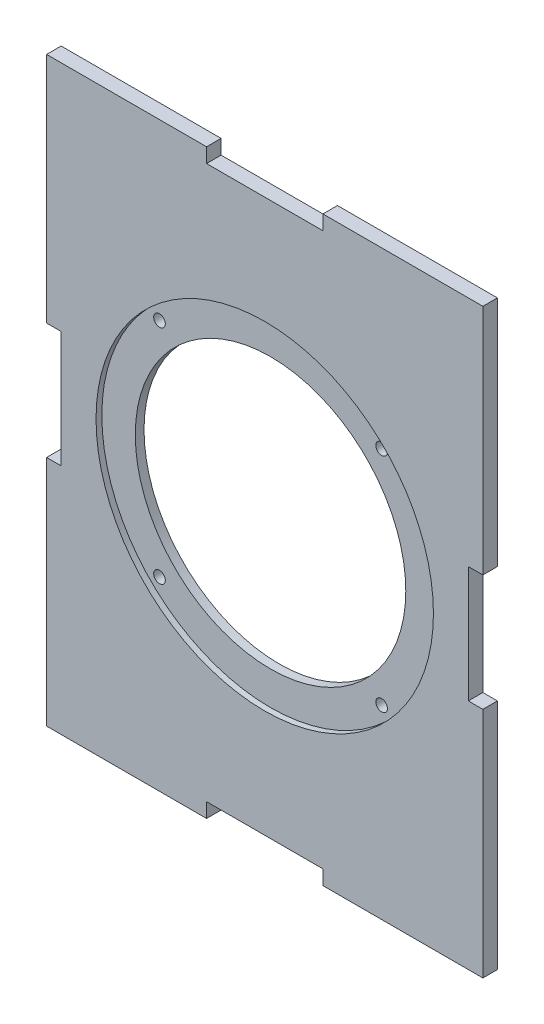
ISO-10303-21;
HEADER;
FILE_DESCRIPTION(('STEP AP214'),'2;1');
FILE_NAME('part.step','',(''),(''),'','','');
FILE_SCHEMA(('AUTOMOTIVE_DESIGN { 1 0 10303 214 1 1 1 1 }'));
ENDSEC;
DATA;
#1=APPLICATION_CONTEXT('core data for automotive mechanical design processes');
#2=APPLICATION_PROTOCOL_DEFINITION('international standard','automotive_design',2000,#1);
#3=PRODUCT_CONTEXT('',#1,'mechanical');
#4=PRODUCT('Part','Part','',(#3));
#5=PRODUCT_RELATED_PRODUCT_CATEGORY('part','',(#4));
#6=PRODUCT_DEFINITION_FORMATION('','',#4);
#7=PRODUCT_DEFINITION_CONTEXT('part definition',#1,'design');
#8=PRODUCT_DEFINITION('design','',#6,#7);
#9=PRODUCT_DEFINITION_SHAPE('','',#8);
#10=(LENGTH_UNIT() NAMED_UNIT(*) SI_UNIT(.MILLI.,.METRE.));
#11=(NAMED_UNIT(*) PLANE_ANGLE_UNIT() SI_UNIT($,.RADIAN.));
#12=(NAMED_UNIT(*) SI_UNIT($,.STERADIAN.) SOLID_ANGLE_UNIT());
#13=UNCERTAINTY_MEASURE_WITH_UNIT(LENGTH_MEASURE(1.E-05),#10,'distance_accuracy_value','');
#14=(GEOMETRIC_REPRESENTATION_CONTEXT(3) GLOBAL_UNCERTAINTY_ASSIGNED_CONTEXT((#13)) GLOBAL_UNIT_ASSIGNED_CONTEXT((#10,
#11,#12)) REPRESENTATION_CONTEXT('',''));
#15=CARTESIAN_POINT('',(0.,0.,0.));
#16=DIRECTION('',(0.,0.,1.));
#17=DIRECTION('',(1.,0.,0.));
#18=AXIS2_PLACEMENT_3D('',#15,#16,#17);
#19=CARTESIAN_POINT('',(75.,-100.,5.));
#20=DIRECTION('',(-1.,0.,0.));
#21=DIRECTION('',(0.,0.,1.));
#22=AXIS2_PLACEMENT_3D('',#19,#20,#21);
#23=PLANE('',#22);
#24=DIRECTION('',(0.,1.,0.));
#25=VECTOR('',#24,1.);
#26=CARTESIAN_POINT('',(75.,-100.,0.));
#27=LINE('',#26,#25);
#28=CARTESIAN_POINT('',(75.,-100.,0.));
#29=VERTEX_POINT('',#28);
#30=CARTESIAN_POINT('',(75.,-20.,0.));
#31=VERTEX_POINT('',#30);
#32=EDGE_CURVE('E201',#29,#31,#27,.T.);
#33=ORIENTED_EDGE('',*,*,#32,.T.);
#34=DIRECTION('',(0.,0.,1.));
#35=VECTOR('',#34,1.);
#36=CARTESIAN_POINT('',(75.,-20.,0.));
#37=LINE('',#36,#35);
#38=CARTESIAN_POINT('',(75.,-20.,5.));
#39=VERTEX_POINT('',#38);
#40=EDGE_CURVE('E269',#31,#39,#37,.T.);
#41=ORIENTED_EDGE('',*,*,#40,.T.);
#42=DIRECTION('',(0.,1.,0.));
#43=VECTOR('',#42,1.);
#44=CARTESIAN_POINT('',(75.,-100.,5.));
#45=LINE('',#44,#43);
#46=CARTESIAN_POINT('',(75.,-100.,5.));
#47=VERTEX_POINT('',#46);
#48=EDGE_CURVE('E319',#47,#39,#45,.T.);
#49=ORIENTED_EDGE('',*,*,#48,.F.);
#50=DIRECTION('',(0.,0.,-1.));
#51=VECTOR('',#50,1.);
#52=CARTESIAN_POINT('',(75.,-100.,5.));
#53=LINE('',#52,#51);
#54=EDGE_CURVE('E211',#47,#29,#53,.T.);
#55=ORIENTED_EDGE('',*,*,#54,.T.);
#56=EDGE_LOOP('',(#33,#41,#49,#55));
#57=FACE_BOUND('',#56,.T.);
#58=ADVANCED_FACE('F33',(#57),#23,.F.);
#59=CARTESIAN_POINT('',(-75.,100.,5.));
#60=DIRECTION('',(0.,-1.,0.));
#61=DIRECTION('',(0.,0.,-1.));
#62=AXIS2_PLACEMENT_3D('',#59,#60,#61);
#63=PLANE('',#62);
#64=DIRECTION('',(-1.,0.,0.));
#65=VECTOR('',#64,1.);
#66=CARTESIAN_POINT('',(-75.,100.,0.));
#67=LINE('',#66,#65);
#68=CARTESIAN_POINT('',(75.,100.,0.));
#69=VERTEX_POINT('',#68);
#70=CARTESIAN_POINT('',(20.,100.,0.));
#71=VERTEX_POINT('',#70);
#72=EDGE_CURVE('E190',#69,#71,#67,.T.);
#73=ORIENTED_EDGE('',*,*,#72,.T.);
#74=DIRECTION('',(0.,0.,1.));
#75=VECTOR('',#74,1.);
#76=CARTESIAN_POINT('',(20.,100.,0.));
#77=LINE('',#76,#75);
#78=CARTESIAN_POINT('',(20.,100.,5.));
#79=VERTEX_POINT('',#78);
#80=EDGE_CURVE('E171',#71,#79,#77,.T.);
#81=ORIENTED_EDGE('',*,*,#80,.T.);
#82=DIRECTION('',(-1.,0.,0.));
#83=VECTOR('',#82,1.);
#84=CARTESIAN_POINT('',(-75.,100.,5.));
#85=LINE('',#84,#83);
#86=CARTESIAN_POINT('',(75.,100.,5.));
#87=VERTEX_POINT('',#86);
#88=EDGE_CURVE('E323',#87,#79,#85,.T.);
#89=ORIENTED_EDGE('',*,*,#88,.F.);
#90=DIRECTION('',(0.,0.,-1.));
#91=VECTOR('',#90,1.);
#92=CARTESIAN_POINT('',(75.,100.,5.));
#93=LINE('',#92,#91);
#94=EDGE_CURVE('E11',#87,#69,#93,.T.);
#95=ORIENTED_EDGE('',*,*,#94,.T.);
#96=EDGE_LOOP('',(#73,#81,#89,#95));
#97=FACE_BOUND('',#96,.T.);
#98=ADVANCED_FACE('F194',(#97),#63,.F.);
#99=CARTESIAN_POINT('',(-75.,-100.,5.));
#100=DIRECTION('',(1.,0.,0.));
#101=DIRECTION('',(0.,0.,-1.));
#102=AXIS2_PLACEMENT_3D('',#99,#100,#101);
#103=PLANE('',#102);
#104=DIRECTION('',(0.,-1.,0.));
#105=VECTOR('',#104,1.);
#106=CARTESIAN_POINT('',(-75.,-100.,0.));
#107=LINE('',#106,#105);
#108=CARTESIAN_POINT('',(-75.,100.,0.));
#109=VERTEX_POINT('',#108);
#110=CARTESIAN_POINT('',(-75.,20.,0.));
#111=VERTEX_POINT('',#110);
#112=EDGE_CURVE('E199',#109,#111,#107,.T.);
#113=ORIENTED_EDGE('',*,*,#112,.T.);
#114=DIRECTION('',(0.,0.,1.));
#115=VECTOR('',#114,1.);
#116=CARTESIAN_POINT('',(-75.,20.,0.));
#117=LINE('',#116,#115);
#118=CARTESIAN_POINT('',(-75.,20.,5.));
#119=VERTEX_POINT('',#118);
#120=EDGE_CURVE('E255',#111,#119,#117,.T.);
#121=ORIENTED_EDGE('',*,*,#120,.T.);
#122=DIRECTION('',(0.,-1.,0.));
#123=VECTOR('',#122,1.);
#124=CARTESIAN_POINT('',(-75.,-100.,5.));
#125=LINE('',#124,#123);
#126=CARTESIAN_POINT('',(-75.,100.,5.));
#127=VERTEX_POINT('',#126);
#128=EDGE_CURVE('E226',#127,#119,#125,.T.);
#129=ORIENTED_EDGE('',*,*,#128,.F.);
#130=DIRECTION('',(0.,0.,-1.));
#131=VECTOR('',#130,1.);
#132=CARTESIAN_POINT('',(-75.,100.,5.));
#133=LINE('',#132,#131);
#134=EDGE_CURVE('E42',#127,#109,#133,.T.);
#135=ORIENTED_EDGE('',*,*,#134,.T.);
#136=EDGE_LOOP('',(#113,#121,#129,#135));
#137=FACE_BOUND('',#136,.T.);
#138=ADVANCED_FACE('F223',(#137),#103,.F.);
#139=CARTESIAN_POINT('',(-75.,-100.,5.));
#140=DIRECTION('',(0.,1.,0.));
#141=DIRECTION('',(0.,0.,1.));
#142=AXIS2_PLACEMENT_3D('',#139,#140,#141);
#143=PLANE('',#142);
#144=DIRECTION('',(1.,0.,0.));
#145=VECTOR('',#144,1.);
#146=CARTESIAN_POINT('',(-75.,-100.,0.));
#147=LINE('',#146,#145);
#148=CARTESIAN_POINT('',(-75.,-100.,0.));
#149=VERTEX_POINT('',#148);
#150=CARTESIAN_POINT('',(-20.,-100.,0.));
#151=VERTEX_POINT('',#150);
#152=EDGE_CURVE('E207',#149,#151,#147,.T.);
#153=ORIENTED_EDGE('',*,*,#152,.T.);
#154=DIRECTION('',(0.,0.,1.));
#155=VECTOR('',#154,1.);
#156=CARTESIAN_POINT('',(-20.,-100.,0.));
#157=LINE('',#156,#155);
#158=CARTESIAN_POINT('',(-20.,-100.,5.));
#159=VERTEX_POINT('',#158);
#160=EDGE_CURVE('E406',#151,#159,#157,.T.);
#161=ORIENTED_EDGE('',*,*,#160,.T.);
#162=DIRECTION('',(1.,0.,0.));
#163=VECTOR('',#162,1.);
#164=CARTESIAN_POINT('',(-75.,-100.,5.));
#165=LINE('',#164,#163);
#166=CARTESIAN_POINT('',(-75.,-100.,5.));
#167=VERTEX_POINT('',#166);
#168=EDGE_CURVE('E215',#167,#159,#165,.T.);
#169=ORIENTED_EDGE('',*,*,#168,.F.);
#170=DIRECTION('',(0.,0.,-1.));
#171=VECTOR('',#170,1.);
#172=CARTESIAN_POINT('',(-75.,-100.,5.));
#173=LINE('',#172,#171);
#174=EDGE_CURVE('E214',#167,#149,#173,.T.);
#175=ORIENTED_EDGE('',*,*,#174,.T.);
#176=EDGE_LOOP('',(#153,#161,#169,#175));
#177=FACE_BOUND('',#176,.T.);
#178=ADVANCED_FACE('F387',(#177),#143,.F.);
#179=CARTESIAN_POINT('',(0.,0.,5.));
#180=DIRECTION('',(0.,0.,-1.));
#181=DIRECTION('',(-1.,0.,0.));
#182=AXIS2_PLACEMENT_3D('',#179,#180,#181);
#183=CYLINDRICAL_SURFACE('',#182,46.5);
#184=CARTESIAN_POINT('',(0.,0.,0.));
#185=DIRECTION('',(0.,0.,1.));
#186=DIRECTION('',(1.,0.,0.));
#187=AXIS2_PLACEMENT_3D('',#184,#185,#186);
#188=CIRCLE('',#187,46.5);
#189=CARTESIAN_POINT('',(46.5,0.,0.));
#190=VERTEX_POINT('',#189);
#191=EDGE_CURVE('E315',#190,#190,#188,.T.);
#192=ORIENTED_EDGE('',*,*,#191,.F.);
#193=EDGE_LOOP('',(#192));
#194=FACE_BOUND('',#193,.T.);
#195=CARTESIAN_POINT('',(0.,0.,3.));
#196=DIRECTION('',(0.,0.,1.));
#197=DIRECTION('',(1.,0.,0.));
#198=AXIS2_PLACEMENT_3D('',#195,#196,#197);
#199=CIRCLE('',#198,46.5);
#200=CARTESIAN_POINT('',(46.5,0.,3.));
#201=VERTEX_POINT('',#200);
#202=EDGE_CURVE('E300',#201,#201,#199,.T.);
#203=ORIENTED_EDGE('',*,*,#202,.T.);
#204=EDGE_LOOP('',(#203));
#205=FACE_BOUND('',#204,.T.);
#206=ADVANCED_FACE('F397',(#194,#205),#183,.F.);
#207=CARTESIAN_POINT('',(-38.1837661840736,38.1837661840735,5.));
#208=DIRECTION('',(0.,0.,-1.));
#209=DIRECTION('',(-1.,0.,0.));
#210=AXIS2_PLACEMENT_3D('',#207,#208,#209);
#211=CYLINDRICAL_SURFACE('',#210,2.);
#212=CARTESIAN_POINT('',(-38.1837661840736,38.1837661840735,0.));
#213=DIRECTION('',(0.,0.,1.));
#214=DIRECTION('',(1.,0.,0.));
#215=AXIS2_PLACEMENT_3D('',#212,#213,#214);
#216=CIRCLE('',#215,2.);
#217=CARTESIAN_POINT('',(-36.1837661840736,38.1837661840735,0.));
#218=VERTEX_POINT('',#217);
#219=EDGE_CURVE('E312',#218,#218,#216,.T.);
#220=ORIENTED_EDGE('',*,*,#219,.F.);
#221=EDGE_LOOP('',(#220));
#222=FACE_BOUND('',#221,.T.);
#223=CARTESIAN_POINT('',(-38.1837661840736,38.1837661840735,3.));
#224=DIRECTION('',(0.,0.,1.));
#225=DIRECTION('',(1.,0.,0.));
#226=AXIS2_PLACEMENT_3D('',#223,#224,#225);
#227=CIRCLE('',#226,2.);
#228=CARTESIAN_POINT('',(-36.1837661840736,38.1837661840735,3.));
#229=VERTEX_POINT('',#228);
#230=EDGE_CURVE('E297',#229,#229,#227,.T.);
#231=ORIENTED_EDGE('',*,*,#230,.T.);
#232=EDGE_LOOP('',(#231));
#233=FACE_BOUND('',#232,.T.);
#234=ADVANCED_FACE('F402',(#222,#233),#211,.F.);
#235=CARTESIAN_POINT('',(38.1837661840735,38.1837661840757,5.));
#236=DIRECTION('',(0.,0.,-1.));
#237=DIRECTION('',(-1.,0.,0.));
#238=AXIS2_PLACEMENT_3D('',#235,#236,#237);
#239=CYLINDRICAL_SURFACE('',#238,2.);
#240=CARTESIAN_POINT('',(38.1837661840735,38.1837661840757,0.));
#241=DIRECTION('',(0.,0.,1.));
#242=DIRECTION('',(1.,0.,0.));
#243=AXIS2_PLACEMENT_3D('',#240,#241,#242);
#244=CIRCLE('',#243,2.);
#245=CARTESIAN_POINT('',(40.1837661840735,38.1837661840757,0.));
#246=VERTEX_POINT('',#245);
#247=EDGE_CURVE('E309',#246,#246,#244,.T.);
#248=ORIENTED_EDGE('',*,*,#247,.F.);
#249=EDGE_LOOP('',(#248));
#250=FACE_BOUND('',#249,.T.);
#251=CARTESIAN_POINT('',(38.1837661840735,38.1837661840757,3.));
#252=DIRECTION('',(0.,0.,1.));
#253=DIRECTION('',(1.,0.,0.));
#254=AXIS2_PLACEMENT_3D('',#251,#252,#253);
#255=CIRCLE('',#254,2.);
#256=CARTESIAN_POINT('',(40.1837661840735,38.1837661840757,3.));
#257=VERTEX_POINT('',#256);
#258=EDGE_CURVE('E294',#257,#257,#255,.T.);
#259=ORIENTED_EDGE('',*,*,#258,.T.);
#260=EDGE_LOOP('',(#259));
#261=FACE_BOUND('',#260,.T.);
#262=ADVANCED_FACE('F510',(#250,#261),#239,.F.);
#263=CARTESIAN_POINT('',(38.1837661840757,-38.1837661840714,5.));
#264=DIRECTION('',(0.,0.,-1.));
#265=DIRECTION('',(-1.,0.,0.));
#266=AXIS2_PLACEMENT_3D('',#263,#264,#265);
#267=CYLINDRICAL_SURFACE('',#266,2.);
#268=CARTESIAN_POINT('',(38.1837661840757,-38.1837661840714,0.));
#269=DIRECTION('',(0.,0.,1.));
#270=DIRECTION('',(1.,0.,0.));
#271=AXIS2_PLACEMENT_3D('',#268,#269,#270);
#272=CIRCLE('',#271,2.);
#273=CARTESIAN_POINT('',(40.1837661840757,-38.1837661840714,0.));
#274=VERTEX_POINT('',#273);
#275=EDGE_CURVE('E306',#274,#274,#272,.T.);
#276=ORIENTED_EDGE('',*,*,#275,.F.);
#277=EDGE_LOOP('',(#276));
#278=FACE_BOUND('',#277,.T.);
#279=CARTESIAN_POINT('',(38.1837661840757,-38.1837661840714,3.));
#280=DIRECTION('',(0.,0.,1.));
#281=DIRECTION('',(1.,0.,0.));
#282=AXIS2_PLACEMENT_3D('',#279,#280,#281);
#283=CIRCLE('',#282,2.);
#284=CARTESIAN_POINT('',(40.1837661840757,-38.1837661840714,3.));
#285=VERTEX_POINT('',#284);
#286=EDGE_CURVE('E291',#285,#285,#283,.T.);
#287=ORIENTED_EDGE('',*,*,#286,.T.);
#288=EDGE_LOOP('',(#287));
#289=FACE_BOUND('',#288,.T.);
#290=ADVANCED_FACE('F506',(#278,#289),#267,.F.);
#291=CARTESIAN_POINT('',(-38.1837661840714,-38.1837661840736,5.));
#292=DIRECTION('',(0.,0.,-1.));
#293=DIRECTION('',(-1.,0.,0.));
#294=AXIS2_PLACEMENT_3D('',#291,#292,#293);
#295=CYLINDRICAL_SURFACE('',#294,2.);
#296=CARTESIAN_POINT('',(-38.1837661840714,-38.1837661840736,0.));
#297=DIRECTION('',(0.,0.,1.));
#298=DIRECTION('',(1.,0.,0.));
#299=AXIS2_PLACEMENT_3D('',#296,#297,#298);
#300=CIRCLE('',#299,2.);
#301=CARTESIAN_POINT('',(-36.1837661840714,-38.1837661840736,0.));
#302=VERTEX_POINT('',#301);
#303=EDGE_CURVE('E303',#302,#302,#300,.T.);
#304=ORIENTED_EDGE('',*,*,#303,.F.);
#305=EDGE_LOOP('',(#304));
#306=FACE_BOUND('',#305,.T.);
#307=CARTESIAN_POINT('',(-38.1837661840714,-38.1837661840736,3.));
#308=DIRECTION('',(0.,0.,1.));
#309=DIRECTION('',(1.,0.,0.));
#310=AXIS2_PLACEMENT_3D('',#307,#308,#309);
#311=CIRCLE('',#310,2.);
#312=CARTESIAN_POINT('',(-36.1837661840714,-38.1837661840736,3.));
#313=VERTEX_POINT('',#312);
#314=EDGE_CURVE('E37',#313,#313,#311,.T.);
#315=ORIENTED_EDGE('',*,*,#314,.T.);
#316=EDGE_LOOP('',(#315));
#317=FACE_BOUND('',#316,.T.);
#318=ADVANCED_FACE('F379',(#306,#317),#295,.F.);
#319=CARTESIAN_POINT('',(0.,0.,5.));
#320=DIRECTION('',(0.,0.,-1.));
#321=DIRECTION('',(-1.,0.,0.));
#322=AXIS2_PLACEMENT_3D('',#319,#320,#321);
#323=PLANE('',#322);
#324=CARTESIAN_POINT('',(0.,0.,5.));
#325=DIRECTION('',(0.,0.,1.));
#326=DIRECTION('',(1.,0.,0.));
#327=AXIS2_PLACEMENT_3D('',#324,#325,#326);
#328=CIRCLE('',#327,58.);
#329=CARTESIAN_POINT('',(58.,0.,5.));
#330=VERTEX_POINT('',#329);
#331=EDGE_CURVE('E287',#330,#330,#328,.T.);
#332=ORIENTED_EDGE('',*,*,#331,.F.);
#333=EDGE_LOOP('',(#332));
#334=FACE_BOUND('',#333,.T.);
#335=ORIENTED_EDGE('',*,*,#88,.T.);
#336=DIRECTION('',(0.,1.,0.));
#337=VECTOR('',#336,1.);
#338=CARTESIAN_POINT('',(20.,100.,5.));
#339=LINE('',#338,#337);
#340=CARTESIAN_POINT('',(20.,95.,5.));
#341=VERTEX_POINT('',#340);
#342=EDGE_CURVE('E177',#341,#79,#339,.T.);
#343=ORIENTED_EDGE('',*,*,#342,.F.);
#344=DIRECTION('',(1.,0.,0.));
#345=VECTOR('',#344,1.);
#346=CARTESIAN_POINT('',(20.,95.,5.));
#347=LINE('',#346,#345);
#348=CARTESIAN_POINT('',(-20.,95.,5.));
#349=VERTEX_POINT('',#348);
#350=EDGE_CURVE('E192',#349,#341,#347,.T.);
#351=ORIENTED_EDGE('',*,*,#350,.F.);
#352=DIRECTION('',(0.,-1.,0.));
#353=VECTOR('',#352,1.);
#354=CARTESIAN_POINT('',(-20.,100.,5.));
#355=LINE('',#354,#353);
#356=CARTESIAN_POINT('',(-20.,100.,5.));
#357=VERTEX_POINT('',#356);
#358=EDGE_CURVE('E446',#357,#349,#355,.T.);
#359=ORIENTED_EDGE('',*,*,#358,.F.);
#360=EDGE_CURVE('E322',#357,#127,#85,.T.);
#361=ORIENTED_EDGE('',*,*,#360,.T.);
#362=ORIENTED_EDGE('',*,*,#128,.T.);
#363=DIRECTION('',(-1.,0.,0.));
#364=VECTOR('',#363,1.);
#365=CARTESIAN_POINT('',(-75.,20.,5.));
#366=LINE('',#365,#364);
#367=CARTESIAN_POINT('',(-70.,20.,5.));
#368=VERTEX_POINT('',#367);
#369=EDGE_CURVE('E253',#368,#119,#366,.T.);
#370=ORIENTED_EDGE('',*,*,#369,.F.);
#371=DIRECTION('',(0.,1.,0.));
#372=VECTOR('',#371,1.);
#373=CARTESIAN_POINT('',(-70.,-20.,5.));
#374=LINE('',#373,#372);
#375=CARTESIAN_POINT('',(-70.,-20.,5.));
#376=VERTEX_POINT('',#375);
#377=EDGE_CURVE('E249',#376,#368,#374,.T.);
#378=ORIENTED_EDGE('',*,*,#377,.F.);
#379=DIRECTION('',(1.,0.,0.));
#380=VECTOR('',#379,1.);
#381=CARTESIAN_POINT('',(-75.,-20.,5.));
#382=LINE('',#381,#380);
#383=CARTESIAN_POINT('',(-75.,-20.,5.));
#384=VERTEX_POINT('',#383);
#385=EDGE_CURVE('E246',#384,#376,#382,.T.);
#386=ORIENTED_EDGE('',*,*,#385,.F.);
#387=EDGE_CURVE('E325',#384,#167,#125,.T.);
#388=ORIENTED_EDGE('',*,*,#387,.T.);
#389=ORIENTED_EDGE('',*,*,#168,.T.);
#390=DIRECTION('',(0.,-1.,0.));
#391=VECTOR('',#390,1.);
#392=CARTESIAN_POINT('',(-20.,-100.,5.));
#393=LINE('',#392,#391);
#394=CARTESIAN_POINT('',(-20.,-95.,5.));
#395=VERTEX_POINT('',#394);
#396=EDGE_CURVE('E429',#395,#159,#393,.T.);
#397=ORIENTED_EDGE('',*,*,#396,.F.);
#398=DIRECTION('',(-1.,0.,0.));
#399=VECTOR('',#398,1.);
#400=CARTESIAN_POINT('',(20.,-95.,5.));
#401=LINE('',#400,#399);
#402=CARTESIAN_POINT('',(20.,-95.,5.));
#403=VERTEX_POINT('',#402);
#404=EDGE_CURVE('E426',#403,#395,#401,.T.);
#405=ORIENTED_EDGE('',*,*,#404,.F.);
#406=DIRECTION('',(0.,1.,0.));
#407=VECTOR('',#406,1.);
#408=CARTESIAN_POINT('',(20.,-100.,5.));
#409=LINE('',#408,#407);
#410=CARTESIAN_POINT('',(20.,-100.,5.));
#411=VERTEX_POINT('',#410);
#412=EDGE_CURVE('E257',#411,#403,#409,.T.);
#413=ORIENTED_EDGE('',*,*,#412,.F.);
#414=EDGE_CURVE('E326',#411,#47,#165,.T.);
#415=ORIENTED_EDGE('',*,*,#414,.T.);
#416=ORIENTED_EDGE('',*,*,#48,.T.);
#417=DIRECTION('',(1.,0.,0.));
#418=VECTOR('',#417,1.);
#419=CARTESIAN_POINT('',(75.,-20.,5.));
#420=LINE('',#419,#418);
#421=CARTESIAN_POINT('',(70.,-20.,5.));
#422=VERTEX_POINT('',#421);
#423=EDGE_CURVE('E270',#422,#39,#420,.T.);
#424=ORIENTED_EDGE('',*,*,#423,.F.);
#425=DIRECTION('',(0.,-1.,0.));
#426=VECTOR('',#425,1.);
#427=CARTESIAN_POINT('',(70.,-20.,5.));
#428=LINE('',#427,#426);
#429=CARTESIAN_POINT('',(70.,20.,5.));
#430=VERTEX_POINT('',#429);
#431=EDGE_CURVE('E264',#430,#422,#428,.T.);
#432=ORIENTED_EDGE('',*,*,#431,.F.);
#433=DIRECTION('',(-1.,0.,0.));
#434=VECTOR('',#433,1.);
#435=CARTESIAN_POINT('',(75.,20.,5.));
#436=LINE('',#435,#434);
#437=CARTESIAN_POINT('',(75.,20.,5.));
#438=VERTEX_POINT('',#437);
#439=EDGE_CURVE('E272',#438,#430,#436,.T.);
#440=ORIENTED_EDGE('',*,*,#439,.F.);
#441=EDGE_CURVE('E210',#438,#87,#45,.T.);
#442=ORIENTED_EDGE('',*,*,#441,.T.);
#443=EDGE_LOOP('',(#335,#343,#351,#359,#361,#362,#370,#378,#386,#388,#389,#397,#405,#413,#415,
#416,#424,#432,#440,#442));
#444=FACE_BOUND('',#443,.T.);
#445=ADVANCED_FACE('F334',(#334,#444),#323,.F.);
#446=CARTESIAN_POINT('',(0.,0.,0.));
#447=DIRECTION('',(0.,0.,-1.));
#448=DIRECTION('',(-1.,0.,0.));
#449=AXIS2_PLACEMENT_3D('',#446,#447,#448);
#450=PLANE('',#449);
#451=DIRECTION('',(0.,1.,0.));
#452=VECTOR('',#451,1.);
#453=CARTESIAN_POINT('',(20.,100.,0.));
#454=LINE('',#453,#452);
#455=CARTESIAN_POINT('',(20.,95.,0.));
#456=VERTEX_POINT('',#455);
#457=EDGE_CURVE('E174',#456,#71,#454,.T.);
#458=ORIENTED_EDGE('',*,*,#457,.T.);
#459=ORIENTED_EDGE('',*,*,#72,.F.);
#460=CARTESIAN_POINT('',(75.,20.,0.));
#461=VERTEX_POINT('',#460);
#462=EDGE_CURVE('E318',#461,#69,#27,.T.);
#463=ORIENTED_EDGE('',*,*,#462,.F.);
#464=DIRECTION('',(-1.,0.,0.));
#465=VECTOR('',#464,1.);
#466=CARTESIAN_POINT('',(75.,20.,0.));
#467=LINE('',#466,#465);
#468=CARTESIAN_POINT('',(70.,20.,0.));
#469=VERTEX_POINT('',#468);
#470=EDGE_CURVE('E49',#461,#469,#467,.T.);
#471=ORIENTED_EDGE('',*,*,#470,.T.);
#472=DIRECTION('',(0.,-1.,0.));
#473=VECTOR('',#472,1.);
#474=CARTESIAN_POINT('',(70.,-20.,0.));
#475=LINE('',#474,#473);
#476=CARTESIAN_POINT('',(70.,-20.,0.));
#477=VERTEX_POINT('',#476);
#478=EDGE_CURVE('E266',#469,#477,#475,.T.);
#479=ORIENTED_EDGE('',*,*,#478,.T.);
#480=DIRECTION('',(1.,0.,0.));
#481=VECTOR('',#480,1.);
#482=CARTESIAN_POINT('',(75.,-20.,0.));
#483=LINE('',#482,#481);
#484=EDGE_CURVE('E261',#477,#31,#483,.T.);
#485=ORIENTED_EDGE('',*,*,#484,.T.);
#486=ORIENTED_EDGE('',*,*,#32,.F.);
#487=CARTESIAN_POINT('',(20.,-100.,0.));
#488=VERTEX_POINT('',#487);
#489=EDGE_CURVE('E206',#488,#29,#147,.T.);
#490=ORIENTED_EDGE('',*,*,#489,.F.);
#491=DIRECTION('',(0.,1.,0.));
#492=VECTOR('',#491,1.);
#493=CARTESIAN_POINT('',(20.,-100.,0.));
#494=LINE('',#493,#492);
#495=CARTESIAN_POINT('',(20.,-95.,0.));
#496=VERTEX_POINT('',#495);
#497=EDGE_CURVE('E421',#488,#496,#494,.T.);
#498=ORIENTED_EDGE('',*,*,#497,.T.);
#499=DIRECTION('',(-1.,0.,0.));
#500=VECTOR('',#499,1.);
#501=CARTESIAN_POINT('',(20.,-95.,0.));
#502=LINE('',#501,#500);
#503=CARTESIAN_POINT('',(-20.,-95.,0.));
#504=VERTEX_POINT('',#503);
#505=EDGE_CURVE('E415',#496,#504,#502,.T.);
#506=ORIENTED_EDGE('',*,*,#505,.T.);
#507=DIRECTION('',(0.,-1.,0.));
#508=VECTOR('',#507,1.);
#509=CARTESIAN_POINT('',(-20.,-100.,0.));
#510=LINE('',#509,#508);
#511=EDGE_CURVE('E412',#504,#151,#510,.T.);
#512=ORIENTED_EDGE('',*,*,#511,.T.);
#513=ORIENTED_EDGE('',*,*,#152,.F.);
#514=CARTESIAN_POINT('',(-75.,-20.,0.));
#515=VERTEX_POINT('',#514);
#516=EDGE_CURVE('E196',#515,#149,#107,.T.);
#517=ORIENTED_EDGE('',*,*,#516,.F.);
#518=DIRECTION('',(1.,0.,0.));
#519=VECTOR('',#518,1.);
#520=CARTESIAN_POINT('',(-75.,-20.,0.));
#521=LINE('',#520,#519);
#522=CARTESIAN_POINT('',(-70.,-20.,0.));
#523=VERTEX_POINT('',#522);
#524=EDGE_CURVE('E242',#515,#523,#521,.T.);
#525=ORIENTED_EDGE('',*,*,#524,.T.);
#526=DIRECTION('',(0.,1.,0.));
#527=VECTOR('',#526,1.);
#528=CARTESIAN_POINT('',(-70.,-20.,0.));
#529=LINE('',#528,#527);
#530=CARTESIAN_POINT('',(-70.,20.,0.));
#531=VERTEX_POINT('',#530);
#532=EDGE_CURVE('E236',#523,#531,#529,.T.);
#533=ORIENTED_EDGE('',*,*,#532,.T.);
#534=DIRECTION('',(-1.,0.,0.));
#535=VECTOR('',#534,1.);
#536=CARTESIAN_POINT('',(-75.,20.,0.));
#537=LINE('',#536,#535);
#538=EDGE_CURVE('E233',#531,#111,#537,.T.);
#539=ORIENTED_EDGE('',*,*,#538,.T.);
#540=ORIENTED_EDGE('',*,*,#112,.F.);
#541=CARTESIAN_POINT('',(-20.,100.,0.));
#542=VERTEX_POINT('',#541);
#543=EDGE_CURVE('E197',#542,#109,#67,.T.);
#544=ORIENTED_EDGE('',*,*,#543,.F.);
#545=DIRECTION('',(0.,-1.,0.));
#546=VECTOR('',#545,1.);
#547=CARTESIAN_POINT('',(-20.,100.,0.));
#548=LINE('',#547,#546);
#549=CARTESIAN_POINT('',(-20.,95.,0.));
#550=VERTEX_POINT('',#549);
#551=EDGE_CURVE('E57',#542,#550,#548,.T.);
#552=ORIENTED_EDGE('',*,*,#551,.T.);
#553=DIRECTION('',(1.,0.,0.));
#554=VECTOR('',#553,1.);
#555=CARTESIAN_POINT('',(20.,95.,0.));
#556=LINE('',#555,#554);
#557=EDGE_CURVE('E183',#550,#456,#556,.T.);
#558=ORIENTED_EDGE('',*,*,#557,.T.);
#559=EDGE_LOOP('',(#458,#459,#463,#471,#479,#485,#486,#490,#498,#506,#512,#513,#517,#525,#533,
#539,#540,#544,#552,#558));
#560=FACE_BOUND('',#559,.T.);
#561=ORIENTED_EDGE('',*,*,#275,.T.);
#562=EDGE_LOOP('',(#561));
#563=FACE_BOUND('',#562,.T.);
#564=ORIENTED_EDGE('',*,*,#219,.T.);
#565=EDGE_LOOP('',(#564));
#566=FACE_BOUND('',#565,.T.);
#567=ORIENTED_EDGE('',*,*,#191,.T.);
#568=EDGE_LOOP('',(#567));
#569=FACE_BOUND('',#568,.T.);
#570=ORIENTED_EDGE('',*,*,#247,.T.);
#571=EDGE_LOOP('',(#570));
#572=FACE_BOUND('',#571,.T.);
#573=ORIENTED_EDGE('',*,*,#303,.T.);
#574=EDGE_LOOP('',(#573));
#575=FACE_BOUND('',#574,.T.);
#576=ADVANCED_FACE('F187',(#560,#563,#566,#569,#572,#575),#450,.T.);
#577=ORIENTED_EDGE('',*,*,#441,.F.);
#578=DIRECTION('',(0.,0.,1.));
#579=VECTOR('',#578,1.);
#580=CARTESIAN_POINT('',(75.,20.,0.));
#581=LINE('',#580,#579);
#582=EDGE_CURVE('E280',#461,#438,#581,.T.);
#583=ORIENTED_EDGE('',*,*,#582,.F.);
#584=ORIENTED_EDGE('',*,*,#462,.T.);
#585=ORIENTED_EDGE('',*,*,#94,.F.);
#586=EDGE_LOOP('',(#577,#583,#584,#585));
#587=FACE_BOUND('',#586,.T.);
#588=ADVANCED_FACE('F35',(#587),#23,.F.);
#589=ORIENTED_EDGE('',*,*,#360,.F.);
#590=DIRECTION('',(0.,0.,1.));
#591=VECTOR('',#590,1.);
#592=CARTESIAN_POINT('',(-20.,100.,0.));
#593=LINE('',#592,#591);
#594=EDGE_CURVE('E182',#542,#357,#593,.T.);
#595=ORIENTED_EDGE('',*,*,#594,.F.);
#596=ORIENTED_EDGE('',*,*,#543,.T.);
#597=ORIENTED_EDGE('',*,*,#134,.F.);
#598=EDGE_LOOP('',(#589,#595,#596,#597));
#599=FACE_BOUND('',#598,.T.);
#600=ADVANCED_FACE('F368',(#599),#63,.F.);
#601=ORIENTED_EDGE('',*,*,#387,.F.);
#602=DIRECTION('',(0.,0.,1.));
#603=VECTOR('',#602,1.);
#604=CARTESIAN_POINT('',(-75.,-20.,0.));
#605=LINE('',#604,#603);
#606=EDGE_CURVE('E238',#515,#384,#605,.T.);
#607=ORIENTED_EDGE('',*,*,#606,.F.);
#608=ORIENTED_EDGE('',*,*,#516,.T.);
#609=ORIENTED_EDGE('',*,*,#174,.F.);
#610=EDGE_LOOP('',(#601,#607,#608,#609));
#611=FACE_BOUND('',#610,.T.);
#612=ADVANCED_FACE('F374',(#611),#103,.F.);
#613=ORIENTED_EDGE('',*,*,#414,.F.);
#614=DIRECTION('',(0.,0.,1.));
#615=VECTOR('',#614,1.);
#616=CARTESIAN_POINT('',(20.,-100.,0.));
#617=LINE('',#616,#615);
#618=EDGE_CURVE('E417',#488,#411,#617,.T.);
#619=ORIENTED_EDGE('',*,*,#618,.F.);
#620=ORIENTED_EDGE('',*,*,#489,.T.);
#621=ORIENTED_EDGE('',*,*,#54,.F.);
#622=EDGE_LOOP('',(#613,#619,#620,#621));
#623=FACE_BOUND('',#622,.T.);
#624=ADVANCED_FACE('F341',(#623),#143,.F.);
#625=CARTESIAN_POINT('',(0.,0.,3.));
#626=DIRECTION('',(0.,0.,1.));
#627=DIRECTION('',(1.,0.,0.));
#628=AXIS2_PLACEMENT_3D('',#625,#626,#627);
#629=CYLINDRICAL_SURFACE('',#628,58.);
#630=CARTESIAN_POINT('',(0.,0.,3.));
#631=DIRECTION('',(0.,0.,1.));
#632=DIRECTION('',(1.,0.,0.));
#633=AXIS2_PLACEMENT_3D('',#630,#631,#632);
#634=CIRCLE('',#633,58.);
#635=CARTESIAN_POINT('',(58.,0.,3.));
#636=VERTEX_POINT('',#635);
#637=EDGE_CURVE('E284',#636,#636,#634,.T.);
#638=ORIENTED_EDGE('',*,*,#637,.F.);
#639=EDGE_LOOP('',(#638));
#640=FACE_BOUND('',#639,.T.);
#641=ORIENTED_EDGE('',*,*,#331,.T.);
#642=EDGE_LOOP('',(#641));
#643=FACE_BOUND('',#642,.T.);
#644=ADVANCED_FACE('F386',(#640,#643),#629,.F.);
#645=CARTESIAN_POINT('',(0.,0.,3.));
#646=DIRECTION('',(0.,0.,1.));
#647=DIRECTION('',(1.,0.,0.));
#648=AXIS2_PLACEMENT_3D('',#645,#646,#647);
#649=PLANE('',#648);
#650=ORIENTED_EDGE('',*,*,#202,.F.);
#651=EDGE_LOOP('',(#650));
#652=FACE_BOUND('',#651,.T.);
#653=ORIENTED_EDGE('',*,*,#230,.F.);
#654=EDGE_LOOP('',(#653));
#655=FACE_BOUND('',#654,.T.);
#656=ORIENTED_EDGE('',*,*,#258,.F.);
#657=EDGE_LOOP('',(#656));
#658=FACE_BOUND('',#657,.T.);
#659=ORIENTED_EDGE('',*,*,#286,.F.);
#660=EDGE_LOOP('',(#659));
#661=FACE_BOUND('',#660,.T.);
#662=ORIENTED_EDGE('',*,*,#314,.F.);
#663=EDGE_LOOP('',(#662));
#664=FACE_BOUND('',#663,.T.);
#665=ORIENTED_EDGE('',*,*,#637,.T.);
#666=EDGE_LOOP('',(#665));
#667=FACE_BOUND('',#666,.T.);
#668=ADVANCED_FACE('F457',(#652,#655,#658,#661,#664,#667),#649,.T.);
#669=CARTESIAN_POINT('',(-20.,-100.,0.));
#670=DIRECTION('',(-1.,0.,0.));
#671=DIRECTION('',(0.,-1.,0.));
#672=AXIS2_PLACEMENT_3D('',#669,#670,#671);
#673=PLANE('',#672);
#674=ORIENTED_EDGE('',*,*,#396,.T.);
#675=ORIENTED_EDGE('',*,*,#160,.F.);
#676=ORIENTED_EDGE('',*,*,#511,.F.);
#677=DIRECTION('',(0.,0.,1.));
#678=VECTOR('',#677,1.);
#679=CARTESIAN_POINT('',(-20.,-95.,0.));
#680=LINE('',#679,#678);
#681=EDGE_CURVE('E432',#504,#395,#680,.T.);
#682=ORIENTED_EDGE('',*,*,#681,.T.);
#683=EDGE_LOOP('',(#674,#675,#676,#682));
#684=FACE_BOUND('',#683,.T.);
#685=ADVANCED_FACE('F455',(#684),#673,.F.);
#686=CARTESIAN_POINT('',(20.,-95.,0.));
#687=DIRECTION('',(0.,1.,0.));
#688=DIRECTION('',(-1.,0.,0.));
#689=AXIS2_PLACEMENT_3D('',#686,#687,#688);
#690=PLANE('',#689);
#691=ORIENTED_EDGE('',*,*,#404,.T.);
#692=ORIENTED_EDGE('',*,*,#681,.F.);
#693=ORIENTED_EDGE('',*,*,#505,.F.);
#694=DIRECTION('',(0.,0.,1.));
#695=VECTOR('',#694,1.);
#696=CARTESIAN_POINT('',(20.,-95.,0.));
#697=LINE('',#696,#695);
#698=EDGE_CURVE('E419',#496,#403,#697,.T.);
#699=ORIENTED_EDGE('',*,*,#698,.T.);
#700=EDGE_LOOP('',(#691,#692,#693,#699));
#701=FACE_BOUND('',#700,.T.);
#702=ADVANCED_FACE('F454',(#701),#690,.F.);
#703=CARTESIAN_POINT('',(20.,-100.,0.));
#704=DIRECTION('',(1.,0.,0.));
#705=DIRECTION('',(0.,1.,0.));
#706=AXIS2_PLACEMENT_3D('',#703,#704,#705);
#707=PLANE('',#706);
#708=ORIENTED_EDGE('',*,*,#412,.T.);
#709=ORIENTED_EDGE('',*,*,#698,.F.);
#710=ORIENTED_EDGE('',*,*,#497,.F.);
#711=ORIENTED_EDGE('',*,*,#618,.T.);
#712=EDGE_LOOP('',(#708,#709,#710,#711));
#713=FACE_BOUND('',#712,.T.);
#714=ADVANCED_FACE('F452',(#713),#707,.F.);
#715=CARTESIAN_POINT('',(-75.,20.,0.));
#716=DIRECTION('',(0.,1.,0.));
#717=DIRECTION('',(-1.,0.,0.));
#718=AXIS2_PLACEMENT_3D('',#715,#716,#717);
#719=PLANE('',#718);
#720=ORIENTED_EDGE('',*,*,#369,.T.);
#721=ORIENTED_EDGE('',*,*,#120,.F.);
#722=ORIENTED_EDGE('',*,*,#538,.F.);
#723=DIRECTION('',(0.,0.,1.));
#724=VECTOR('',#723,1.);
#725=CARTESIAN_POINT('',(-70.,20.,0.));
#726=LINE('',#725,#724);
#727=EDGE_CURVE('E258',#531,#368,#726,.T.);
#728=ORIENTED_EDGE('',*,*,#727,.T.);
#729=EDGE_LOOP('',(#720,#721,#722,#728));
#730=FACE_BOUND('',#729,.T.);
#731=ADVANCED_FACE('F442',(#730),#719,.F.);
#732=CARTESIAN_POINT('',(-70.,-20.,0.));
#733=DIRECTION('',(1.,0.,0.));
#734=DIRECTION('',(0.,1.,0.));
#735=AXIS2_PLACEMENT_3D('',#732,#733,#734);
#736=PLANE('',#735);
#737=ORIENTED_EDGE('',*,*,#377,.T.);
#738=ORIENTED_EDGE('',*,*,#727,.F.);
#739=ORIENTED_EDGE('',*,*,#532,.F.);
#740=DIRECTION('',(0.,0.,1.));
#741=VECTOR('',#740,1.);
#742=CARTESIAN_POINT('',(-70.,-20.,0.));
#743=LINE('',#742,#741);
#744=EDGE_CURVE('E240',#523,#376,#743,.T.);
#745=ORIENTED_EDGE('',*,*,#744,.T.);
#746=EDGE_LOOP('',(#737,#738,#739,#745));
#747=FACE_BOUND('',#746,.T.);
#748=ADVANCED_FACE('F441',(#747),#736,.F.);
#749=CARTESIAN_POINT('',(-75.,-20.,0.));
#750=DIRECTION('',(0.,-1.,0.));
#751=DIRECTION('',(1.,0.,0.));
#752=AXIS2_PLACEMENT_3D('',#749,#750,#751);
#753=PLANE('',#752);
#754=ORIENTED_EDGE('',*,*,#385,.T.);
#755=ORIENTED_EDGE('',*,*,#744,.F.);
#756=ORIENTED_EDGE('',*,*,#524,.F.);
#757=ORIENTED_EDGE('',*,*,#606,.T.);
#758=EDGE_LOOP('',(#754,#755,#756,#757));
#759=FACE_BOUND('',#758,.T.);
#760=ADVANCED_FACE('F436',(#759),#753,.F.);
#761=CARTESIAN_POINT('',(20.,100.,0.));
#762=DIRECTION('',(1.,0.,0.));
#763=DIRECTION('',(0.,1.,0.));
#764=AXIS2_PLACEMENT_3D('',#761,#762,#763);
#765=PLANE('',#764);
#766=ORIENTED_EDGE('',*,*,#342,.T.);
#767=ORIENTED_EDGE('',*,*,#80,.F.);
#768=ORIENTED_EDGE('',*,*,#457,.F.);
#769=DIRECTION('',(0.,0.,1.));
#770=VECTOR('',#769,1.);
#771=CARTESIAN_POINT('',(20.,95.,0.));
#772=LINE('',#771,#770);
#773=EDGE_CURVE('E290',#456,#341,#772,.T.);
#774=ORIENTED_EDGE('',*,*,#773,.T.);
#775=EDGE_LOOP('',(#766,#767,#768,#774));
#776=FACE_BOUND('',#775,.T.);
#777=ADVANCED_FACE('F173',(#776),#765,.F.);
#778=CARTESIAN_POINT('',(20.,95.,0.));
#779=DIRECTION('',(0.,-1.,0.));
#780=DIRECTION('',(1.,0.,0.));
#781=AXIS2_PLACEMENT_3D('',#778,#779,#780);
#782=PLANE('',#781);
#783=ORIENTED_EDGE('',*,*,#350,.T.);
#784=ORIENTED_EDGE('',*,*,#773,.F.);
#785=ORIENTED_EDGE('',*,*,#557,.F.);
#786=DIRECTION('',(0.,0.,1.));
#787=VECTOR('',#786,1.);
#788=CARTESIAN_POINT('',(-20.,95.,0.));
#789=LINE('',#788,#787);
#790=EDGE_CURVE('E447',#550,#349,#789,.T.);
#791=ORIENTED_EDGE('',*,*,#790,.T.);
#792=EDGE_LOOP('',(#783,#784,#785,#791));
#793=FACE_BOUND('',#792,.T.);
#794=ADVANCED_FACE('F479',(#793),#782,.F.);
#795=CARTESIAN_POINT('',(-20.,100.,0.));
#796=DIRECTION('',(-1.,0.,0.));
#797=DIRECTION('',(0.,-1.,0.));
#798=AXIS2_PLACEMENT_3D('',#795,#796,#797);
#799=PLANE('',#798);
#800=ORIENTED_EDGE('',*,*,#358,.T.);
#801=ORIENTED_EDGE('',*,*,#790,.F.);
#802=ORIENTED_EDGE('',*,*,#551,.F.);
#803=ORIENTED_EDGE('',*,*,#594,.T.);
#804=EDGE_LOOP('',(#800,#801,#802,#803));
#805=FACE_BOUND('',#804,.T.);
#806=ADVANCED_FACE('F483',(#805),#799,.F.);
#807=CARTESIAN_POINT('',(75.,-20.,0.));
#808=DIRECTION('',(0.,-1.,0.));
#809=DIRECTION('',(1.,0.,0.));
#810=AXIS2_PLACEMENT_3D('',#807,#808,#809);
#811=PLANE('',#810);
#812=ORIENTED_EDGE('',*,*,#423,.T.);
#813=ORIENTED_EDGE('',*,*,#40,.F.);
#814=ORIENTED_EDGE('',*,*,#484,.F.);
#815=DIRECTION('',(0.,0.,1.));
#816=VECTOR('',#815,1.);
#817=CARTESIAN_POINT('',(70.,-20.,0.));
#818=LINE('',#817,#816);
#819=EDGE_CURVE('E250',#477,#422,#818,.T.);
#820=ORIENTED_EDGE('',*,*,#819,.T.);
#821=EDGE_LOOP('',(#812,#813,#814,#820));
#822=FACE_BOUND('',#821,.T.);
#823=ADVANCED_FACE('F348',(#822),#811,.F.);
#824=CARTESIAN_POINT('',(70.,-20.,0.));
#825=DIRECTION('',(-1.,0.,0.));
#826=DIRECTION('',(0.,-1.,0.));
#827=AXIS2_PLACEMENT_3D('',#824,#825,#826);
#828=PLANE('',#827);
#829=ORIENTED_EDGE('',*,*,#431,.T.);
#830=ORIENTED_EDGE('',*,*,#819,.F.);
#831=ORIENTED_EDGE('',*,*,#478,.F.);
#832=DIRECTION('',(0.,0.,1.));
#833=VECTOR('',#832,1.);
#834=CARTESIAN_POINT('',(70.,20.,0.));
#835=LINE('',#834,#833);
#836=EDGE_CURVE('E278',#469,#430,#835,.T.);
#837=ORIENTED_EDGE('',*,*,#836,.T.);
#838=EDGE_LOOP('',(#829,#830,#831,#837));
#839=FACE_BOUND('',#838,.T.);
#840=ADVANCED_FACE('F351',(#839),#828,.F.);
#841=CARTESIAN_POINT('',(75.,20.,0.));
#842=DIRECTION('',(0.,1.,0.));
#843=DIRECTION('',(-1.,0.,0.));
#844=AXIS2_PLACEMENT_3D('',#841,#842,#843);
#845=PLANE('',#844);
#846=ORIENTED_EDGE('',*,*,#439,.T.);
#847=ORIENTED_EDGE('',*,*,#836,.F.);
#848=ORIENTED_EDGE('',*,*,#470,.F.);
#849=ORIENTED_EDGE('',*,*,#582,.T.);
#850=EDGE_LOOP('',(#846,#847,#848,#849));
#851=FACE_BOUND('',#850,.T.);
#852=ADVANCED_FACE('F356',(#851),#845,.F.);
#853=CLOSED_SHELL('',(#58,#98,#138,#178,#206,#234,#262,#290,#318,#445,#576,#588,#600,#612,#624,
#644,#668,#685,#702,#714,#731,#748,#760,#777,#794,#806,#823,#840,#852));
#854=MANIFOLD_SOLID_BREP('B2',#853);
#855=ADVANCED_BREP_SHAPE_REPRESENTATION('',(#18,#854),#14);
#856=SHAPE_DEFINITION_REPRESENTATION(#9,#855);
ENDSEC;
END-ISO-10303-21;
